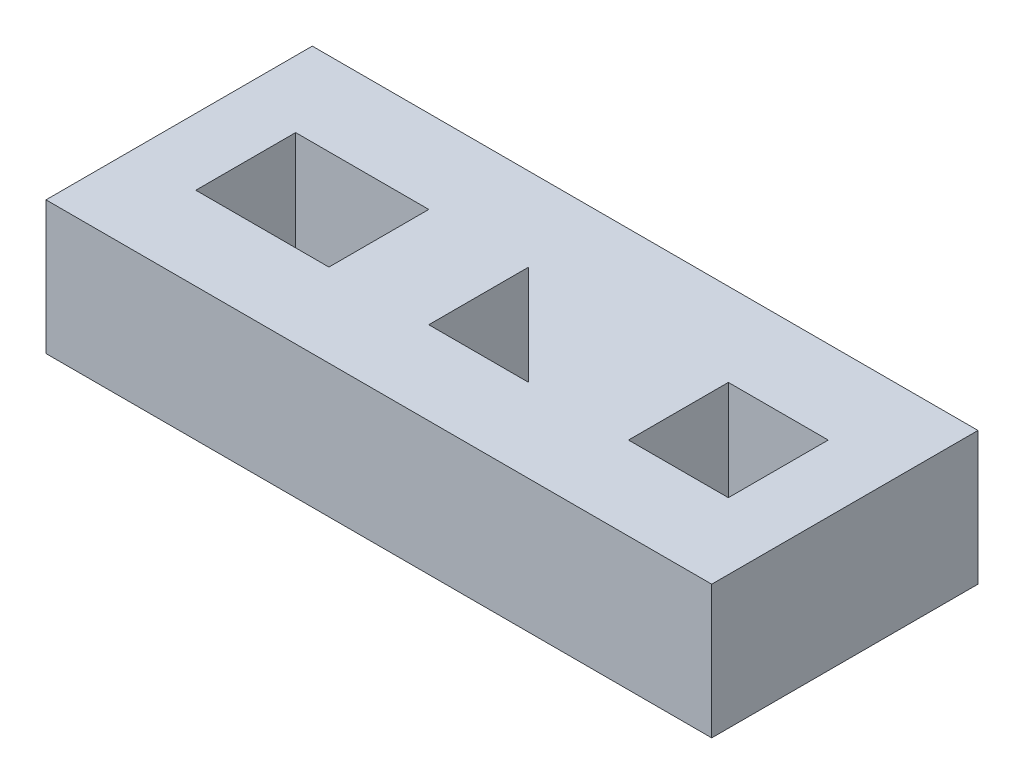
ISO-10303-21;
HEADER;
FILE_DESCRIPTION(('STEP AP214'),'2;1');
FILE_NAME('part.step','',(''),(''),'','','');
FILE_SCHEMA(('AUTOMOTIVE_DESIGN { 1 0 10303 214 1 1 1 1 }'));
ENDSEC;
DATA;
#1=APPLICATION_CONTEXT('core data for automotive mechanical design processes');
#2=APPLICATION_PROTOCOL_DEFINITION('international standard','automotive_design',2000,#1);
#3=PRODUCT_CONTEXT('',#1,'mechanical');
#4=PRODUCT('Part','Part','',(#3));
#5=PRODUCT_RELATED_PRODUCT_CATEGORY('part','',(#4));
#6=PRODUCT_DEFINITION_FORMATION('','',#4);
#7=PRODUCT_DEFINITION_CONTEXT('part definition',#1,'design');
#8=PRODUCT_DEFINITION('design','',#6,#7);
#9=PRODUCT_DEFINITION_SHAPE('','',#8);
#10=(LENGTH_UNIT() NAMED_UNIT(*) SI_UNIT(.MILLI.,.METRE.));
#11=(NAMED_UNIT(*) PLANE_ANGLE_UNIT() SI_UNIT($,.RADIAN.));
#12=(NAMED_UNIT(*) SI_UNIT($,.STERADIAN.) SOLID_ANGLE_UNIT());
#13=UNCERTAINTY_MEASURE_WITH_UNIT(LENGTH_MEASURE(1.E-05),#10,'distance_accuracy_value','');
#14=(GEOMETRIC_REPRESENTATION_CONTEXT(3) GLOBAL_UNCERTAINTY_ASSIGNED_CONTEXT((#13)) GLOBAL_UNIT_ASSIGNED_CONTEXT((#10,
#11,#12)) REPRESENTATION_CONTEXT('',''));
#15=CARTESIAN_POINT('',(0.,0.,0.));
#16=DIRECTION('',(0.,0.,1.));
#17=DIRECTION('',(1.,0.,0.));
#18=AXIS2_PLACEMENT_3D('',#15,#16,#17);
#19=CARTESIAN_POINT('',(0.,25.4,0.));
#20=DIRECTION('',(1.,0.,0.));
#21=DIRECTION('',(0.,0.,-1.));
#22=AXIS2_PLACEMENT_3D('',#19,#20,#21);
#23=PLANE('',#22);
#24=DIRECTION('',(0.,0.,1.));
#25=VECTOR('',#24,1.);
#26=CARTESIAN_POINT('',(0.,0.,0.));
#27=LINE('',#26,#25);
#28=CARTESIAN_POINT('',(0.,0.,-50.8));
#29=VERTEX_POINT('',#28);
#30=CARTESIAN_POINT('',(0.,0.,0.));
#31=VERTEX_POINT('',#30);
#32=EDGE_CURVE('E223',#29,#31,#27,.T.);
#33=ORIENTED_EDGE('',*,*,#32,.T.);
#34=DIRECTION('',(0.,-1.,0.));
#35=VECTOR('',#34,1.);
#36=CARTESIAN_POINT('',(0.,25.4,0.));
#37=LINE('',#36,#35);
#38=CARTESIAN_POINT('',(0.,25.4,0.));
#39=VERTEX_POINT('',#38);
#40=EDGE_CURVE('E11',#39,#31,#37,.T.);
#41=ORIENTED_EDGE('',*,*,#40,.F.);
#42=DIRECTION('',(0.,0.,1.));
#43=VECTOR('',#42,1.);
#44=CARTESIAN_POINT('',(0.,25.4,0.));
#45=LINE('',#44,#43);
#46=CARTESIAN_POINT('',(0.,25.4,-50.8));
#47=VERTEX_POINT('',#46);
#48=EDGE_CURVE('E230',#47,#39,#45,.T.);
#49=ORIENTED_EDGE('',*,*,#48,.F.);
#50=DIRECTION('',(0.,-1.,0.));
#51=VECTOR('',#50,1.);
#52=CARTESIAN_POINT('',(0.,25.4,-50.8));
#53=LINE('',#52,#51);
#54=EDGE_CURVE('E240',#47,#29,#53,.T.);
#55=ORIENTED_EDGE('',*,*,#54,.T.);
#56=EDGE_LOOP('',(#33,#41,#49,#55));
#57=FACE_BOUND('',#56,.T.);
#58=ADVANCED_FACE('F32',(#57),#23,.F.);
#59=CARTESIAN_POINT('',(0.,25.4,0.));
#60=DIRECTION('',(0.,0.,-1.));
#61=DIRECTION('',(-1.,0.,0.));
#62=AXIS2_PLACEMENT_3D('',#59,#60,#61);
#63=PLANE('',#62);
#64=DIRECTION('',(1.,0.,0.));
#65=VECTOR('',#64,1.);
#66=CARTESIAN_POINT('',(0.,0.,0.));
#67=LINE('',#66,#65);
#68=CARTESIAN_POINT('',(127.,0.,0.));
#69=VERTEX_POINT('',#68);
#70=EDGE_CURVE('E243',#31,#69,#67,.T.);
#71=ORIENTED_EDGE('',*,*,#70,.T.);
#72=DIRECTION('',(0.,-1.,0.));
#73=VECTOR('',#72,1.);
#74=CARTESIAN_POINT('',(127.,25.4,0.));
#75=LINE('',#74,#73);
#76=CARTESIAN_POINT('',(127.,25.4,0.));
#77=VERTEX_POINT('',#76);
#78=EDGE_CURVE('E39',#77,#69,#75,.T.);
#79=ORIENTED_EDGE('',*,*,#78,.F.);
#80=DIRECTION('',(1.,0.,0.));
#81=VECTOR('',#80,1.);
#82=CARTESIAN_POINT('',(0.,25.4,0.));
#83=LINE('',#82,#81);
#84=EDGE_CURVE('E233',#39,#77,#83,.T.);
#85=ORIENTED_EDGE('',*,*,#84,.F.);
#86=ORIENTED_EDGE('',*,*,#40,.T.);
#87=EDGE_LOOP('',(#71,#79,#85,#86));
#88=FACE_BOUND('',#87,.T.);
#89=ADVANCED_FACE('F272',(#88),#63,.F.);
#90=CARTESIAN_POINT('',(127.,25.4,0.));
#91=DIRECTION('',(-1.,0.,0.));
#92=DIRECTION('',(0.,0.,1.));
#93=AXIS2_PLACEMENT_3D('',#90,#91,#92);
#94=PLANE('',#93);
#95=DIRECTION('',(0.,0.,-1.));
#96=VECTOR('',#95,1.);
#97=CARTESIAN_POINT('',(127.,0.,0.));
#98=LINE('',#97,#96);
#99=CARTESIAN_POINT('',(127.,0.,-50.8));
#100=VERTEX_POINT('',#99);
#101=EDGE_CURVE('E245',#69,#100,#98,.T.);
#102=ORIENTED_EDGE('',*,*,#101,.T.);
#103=DIRECTION('',(0.,-1.,0.));
#104=VECTOR('',#103,1.);
#105=CARTESIAN_POINT('',(127.,25.4,-50.8));
#106=LINE('',#105,#104);
#107=CARTESIAN_POINT('',(127.,25.4,-50.8));
#108=VERTEX_POINT('',#107);
#109=EDGE_CURVE('E250',#108,#100,#106,.T.);
#110=ORIENTED_EDGE('',*,*,#109,.F.);
#111=DIRECTION('',(0.,0.,-1.));
#112=VECTOR('',#111,1.);
#113=CARTESIAN_POINT('',(127.,25.4,0.));
#114=LINE('',#113,#112);
#115=EDGE_CURVE('E236',#77,#108,#114,.T.);
#116=ORIENTED_EDGE('',*,*,#115,.F.);
#117=ORIENTED_EDGE('',*,*,#78,.T.);
#118=EDGE_LOOP('',(#102,#110,#116,#117));
#119=FACE_BOUND('',#118,.T.);
#120=ADVANCED_FACE('F257',(#119),#94,.F.);
#121=CARTESIAN_POINT('',(0.,25.4,-50.8));
#122=DIRECTION('',(0.,0.,1.));
#123=DIRECTION('',(1.,0.,0.));
#124=AXIS2_PLACEMENT_3D('',#121,#122,#123);
#125=PLANE('',#124);
#126=DIRECTION('',(-1.,0.,0.));
#127=VECTOR('',#126,1.);
#128=CARTESIAN_POINT('',(0.,0.,-50.8));
#129=LINE('',#128,#127);
#130=EDGE_CURVE('E234',#100,#29,#129,.T.);
#131=ORIENTED_EDGE('',*,*,#130,.T.);
#132=ORIENTED_EDGE('',*,*,#54,.F.);
#133=DIRECTION('',(-1.,0.,0.));
#134=VECTOR('',#133,1.);
#135=CARTESIAN_POINT('',(0.,25.4,-50.8));
#136=LINE('',#135,#134);
#137=EDGE_CURVE('E238',#108,#47,#136,.T.);
#138=ORIENTED_EDGE('',*,*,#137,.F.);
#139=ORIENTED_EDGE('',*,*,#109,.T.);
#140=EDGE_LOOP('',(#131,#132,#138,#139));
#141=FACE_BOUND('',#140,.T.);
#142=ADVANCED_FACE('F265',(#141),#125,.F.);
#143=CARTESIAN_POINT('',(0.,25.4,0.));
#144=DIRECTION('',(0.,-1.,0.));
#145=DIRECTION('',(0.,0.,-1.));
#146=AXIS2_PLACEMENT_3D('',#143,#144,#145);
#147=PLANE('',#146);
#148=DIRECTION('',(0.,0.,1.));
#149=VECTOR('',#148,1.);
#150=CARTESIAN_POINT('',(57.15,25.4,-34.925));
#151=LINE('',#150,#149);
#152=CARTESIAN_POINT('',(57.15,25.4,-34.925));
#153=VERTEX_POINT('',#152);
#154=CARTESIAN_POINT('',(57.15,25.4,-15.875));
#155=VERTEX_POINT('',#154);
#156=EDGE_CURVE('E156',#153,#155,#151,.T.);
#157=ORIENTED_EDGE('',*,*,#156,.F.);
#158=DIRECTION('',(-0.707106781186548,0.,-0.707106781186547));
#159=VECTOR('',#158,1.);
#160=CARTESIAN_POINT('',(76.2,25.4,-15.875));
#161=LINE('',#160,#159);
#162=CARTESIAN_POINT('',(76.2,25.4,-15.875));
#163=VERTEX_POINT('',#162);
#164=EDGE_CURVE('E46',#163,#153,#161,.T.);
#165=ORIENTED_EDGE('',*,*,#164,.F.);
#166=DIRECTION('',(1.,0.,0.));
#167=VECTOR('',#166,1.);
#168=CARTESIAN_POINT('',(57.15,25.4,-15.875));
#169=LINE('',#168,#167);
#170=EDGE_CURVE('E153',#155,#163,#169,.T.);
#171=ORIENTED_EDGE('',*,*,#170,.F.);
#172=EDGE_LOOP('',(#157,#165,#171));
#173=FACE_BOUND('',#172,.T.);
#174=DIRECTION('',(1.,0.,0.));
#175=VECTOR('',#174,1.);
#176=CARTESIAN_POINT('',(95.25,25.4,-15.875));
#177=LINE('',#176,#175);
#178=CARTESIAN_POINT('',(95.25,25.4,-15.875));
#179=VERTEX_POINT('',#178);
#180=CARTESIAN_POINT('',(114.3,25.4,-15.875));
#181=VERTEX_POINT('',#180);
#182=EDGE_CURVE('E181',#179,#181,#177,.T.);
#183=ORIENTED_EDGE('',*,*,#182,.F.);
#184=DIRECTION('',(0.,0.,1.));
#185=VECTOR('',#184,1.);
#186=CARTESIAN_POINT('',(95.25,25.4,-15.875));
#187=LINE('',#186,#185);
#188=CARTESIAN_POINT('',(95.25,25.4,-34.925));
#189=VERTEX_POINT('',#188);
#190=EDGE_CURVE('E164',#189,#179,#187,.T.);
#191=ORIENTED_EDGE('',*,*,#190,.F.);
#192=DIRECTION('',(-1.,0.,0.));
#193=VECTOR('',#192,1.);
#194=CARTESIAN_POINT('',(95.25,25.4,-34.925));
#195=LINE('',#194,#193);
#196=CARTESIAN_POINT('',(114.3,25.4,-34.925));
#197=VERTEX_POINT('',#196);
#198=EDGE_CURVE('E170',#197,#189,#195,.T.);
#199=ORIENTED_EDGE('',*,*,#198,.F.);
#200=DIRECTION('',(0.,0.,-1.));
#201=VECTOR('',#200,1.);
#202=CARTESIAN_POINT('',(114.3,25.4,-15.875));
#203=LINE('',#202,#201);
#204=EDGE_CURVE('E184',#181,#197,#203,.T.);
#205=ORIENTED_EDGE('',*,*,#204,.F.);
#206=EDGE_LOOP('',(#183,#191,#199,#205));
#207=FACE_BOUND('',#206,.T.);
#208=DIRECTION('',(1.,0.,0.));
#209=VECTOR('',#208,1.);
#210=CARTESIAN_POINT('',(12.7,25.4,-15.875));
#211=LINE('',#210,#209);
#212=CARTESIAN_POINT('',(12.7,25.4,-15.875));
#213=VERTEX_POINT('',#212);
#214=CARTESIAN_POINT('',(38.1,25.4,-15.875));
#215=VERTEX_POINT('',#214);
#216=EDGE_CURVE('E213',#213,#215,#211,.T.);
#217=ORIENTED_EDGE('',*,*,#216,.F.);
#218=DIRECTION('',(0.,0.,1.));
#219=VECTOR('',#218,1.);
#220=CARTESIAN_POINT('',(12.7,25.4,-15.875));
#221=LINE('',#220,#219);
#222=CARTESIAN_POINT('',(12.7,25.4,-34.925));
#223=VERTEX_POINT('',#222);
#224=EDGE_CURVE('E191',#223,#213,#221,.T.);
#225=ORIENTED_EDGE('',*,*,#224,.F.);
#226=DIRECTION('',(-1.,0.,0.));
#227=VECTOR('',#226,1.);
#228=CARTESIAN_POINT('',(12.7,25.4,-34.925));
#229=LINE('',#228,#227);
#230=CARTESIAN_POINT('',(38.1,25.4,-34.925));
#231=VERTEX_POINT('',#230);
#232=EDGE_CURVE('E202',#231,#223,#229,.T.);
#233=ORIENTED_EDGE('',*,*,#232,.F.);
#234=DIRECTION('',(0.,0.,-1.));
#235=VECTOR('',#234,1.);
#236=CARTESIAN_POINT('',(38.1,25.4,-15.875));
#237=LINE('',#236,#235);
#238=EDGE_CURVE('E216',#215,#231,#237,.T.);
#239=ORIENTED_EDGE('',*,*,#238,.F.);
#240=EDGE_LOOP('',(#217,#225,#233,#239));
#241=FACE_BOUND('',#240,.T.);
#242=ORIENTED_EDGE('',*,*,#48,.T.);
#243=ORIENTED_EDGE('',*,*,#84,.T.);
#244=ORIENTED_EDGE('',*,*,#115,.T.);
#245=ORIENTED_EDGE('',*,*,#137,.T.);
#246=EDGE_LOOP('',(#242,#243,#244,#245));
#247=FACE_BOUND('',#246,.T.);
#248=ADVANCED_FACE('F271',(#173,#207,#241,#247),#147,.F.);
#249=CARTESIAN_POINT('',(0.,0.,0.));
#250=DIRECTION('',(0.,-1.,0.));
#251=DIRECTION('',(0.,0.,-1.));
#252=AXIS2_PLACEMENT_3D('',#249,#250,#251);
#253=PLANE('',#252);
#254=DIRECTION('',(-0.707106781186548,0.,-0.707106781186547));
#255=VECTOR('',#254,1.);
#256=CARTESIAN_POINT('',(76.2,0.,-15.875));
#257=LINE('',#256,#255);
#258=CARTESIAN_POINT('',(76.2,0.,-15.875));
#259=VERTEX_POINT('',#258);
#260=CARTESIAN_POINT('',(57.15,0.,-34.925));
#261=VERTEX_POINT('',#260);
#262=EDGE_CURVE('E140',#259,#261,#257,.T.);
#263=ORIENTED_EDGE('',*,*,#262,.T.);
#264=DIRECTION('',(0.,0.,1.));
#265=VECTOR('',#264,1.);
#266=CARTESIAN_POINT('',(57.15,0.,-34.925));
#267=LINE('',#266,#265);
#268=CARTESIAN_POINT('',(57.15,0.,-15.875));
#269=VERTEX_POINT('',#268);
#270=EDGE_CURVE('E147',#261,#269,#267,.T.);
#271=ORIENTED_EDGE('',*,*,#270,.T.);
#272=DIRECTION('',(1.,0.,0.));
#273=VECTOR('',#272,1.);
#274=CARTESIAN_POINT('',(57.15,0.,-15.875));
#275=LINE('',#274,#273);
#276=EDGE_CURVE('E54',#269,#259,#275,.T.);
#277=ORIENTED_EDGE('',*,*,#276,.T.);
#278=EDGE_LOOP('',(#263,#271,#277));
#279=FACE_BOUND('',#278,.T.);
#280=DIRECTION('',(0.,0.,1.));
#281=VECTOR('',#280,1.);
#282=CARTESIAN_POINT('',(95.25,0.,-15.875));
#283=LINE('',#282,#281);
#284=CARTESIAN_POINT('',(95.25,0.,-34.925));
#285=VERTEX_POINT('',#284);
#286=CARTESIAN_POINT('',(95.25,0.,-15.875));
#287=VERTEX_POINT('',#286);
#288=EDGE_CURVE('E166',#285,#287,#283,.T.);
#289=ORIENTED_EDGE('',*,*,#288,.T.);
#290=DIRECTION('',(1.,0.,0.));
#291=VECTOR('',#290,1.);
#292=CARTESIAN_POINT('',(95.25,0.,-15.875));
#293=LINE('',#292,#291);
#294=CARTESIAN_POINT('',(114.3,0.,-15.875));
#295=VERTEX_POINT('',#294);
#296=EDGE_CURVE('E169',#287,#295,#293,.T.);
#297=ORIENTED_EDGE('',*,*,#296,.T.);
#298=DIRECTION('',(0.,0.,-1.));
#299=VECTOR('',#298,1.);
#300=CARTESIAN_POINT('',(114.3,0.,-15.875));
#301=LINE('',#300,#299);
#302=CARTESIAN_POINT('',(114.3,0.,-34.925));
#303=VERTEX_POINT('',#302);
#304=EDGE_CURVE('E173',#295,#303,#301,.T.);
#305=ORIENTED_EDGE('',*,*,#304,.T.);
#306=DIRECTION('',(-1.,0.,0.));
#307=VECTOR('',#306,1.);
#308=CARTESIAN_POINT('',(95.25,0.,-34.925));
#309=LINE('',#308,#307);
#310=EDGE_CURVE('E176',#303,#285,#309,.T.);
#311=ORIENTED_EDGE('',*,*,#310,.T.);
#312=EDGE_LOOP('',(#289,#297,#305,#311));
#313=FACE_BOUND('',#312,.T.);
#314=DIRECTION('',(0.,0.,1.));
#315=VECTOR('',#314,1.);
#316=CARTESIAN_POINT('',(12.7,0.,-15.875));
#317=LINE('',#316,#315);
#318=CARTESIAN_POINT('',(12.7,0.,-34.925));
#319=VERTEX_POINT('',#318);
#320=CARTESIAN_POINT('',(12.7,0.,-15.875));
#321=VERTEX_POINT('',#320);
#322=EDGE_CURVE('E198',#319,#321,#317,.T.);
#323=ORIENTED_EDGE('',*,*,#322,.T.);
#324=DIRECTION('',(1.,0.,0.));
#325=VECTOR('',#324,1.);
#326=CARTESIAN_POINT('',(12.7,0.,-15.875));
#327=LINE('',#326,#325);
#328=CARTESIAN_POINT('',(38.1,0.,-15.875));
#329=VERTEX_POINT('',#328);
#330=EDGE_CURVE('E201',#321,#329,#327,.T.);
#331=ORIENTED_EDGE('',*,*,#330,.T.);
#332=DIRECTION('',(0.,0.,-1.));
#333=VECTOR('',#332,1.);
#334=CARTESIAN_POINT('',(38.1,0.,-15.875));
#335=LINE('',#334,#333);
#336=CARTESIAN_POINT('',(38.1,0.,-34.925));
#337=VERTEX_POINT('',#336);
#338=EDGE_CURVE('E205',#329,#337,#335,.T.);
#339=ORIENTED_EDGE('',*,*,#338,.T.);
#340=DIRECTION('',(-1.,0.,0.));
#341=VECTOR('',#340,1.);
#342=CARTESIAN_POINT('',(12.7,0.,-34.925));
#343=LINE('',#342,#341);
#344=EDGE_CURVE('E208',#337,#319,#343,.T.);
#345=ORIENTED_EDGE('',*,*,#344,.T.);
#346=EDGE_LOOP('',(#323,#331,#339,#345));
#347=FACE_BOUND('',#346,.T.);
#348=ORIENTED_EDGE('',*,*,#32,.F.);
#349=ORIENTED_EDGE('',*,*,#130,.F.);
#350=ORIENTED_EDGE('',*,*,#101,.F.);
#351=ORIENTED_EDGE('',*,*,#70,.F.);
#352=EDGE_LOOP('',(#348,#349,#350,#351));
#353=FACE_BOUND('',#352,.T.);
#354=ADVANCED_FACE('F151',(#279,#313,#347,#353),#253,.T.);
#355=CARTESIAN_POINT('',(12.7,0.,-15.875));
#356=DIRECTION('',(-1.,0.,0.));
#357=DIRECTION('',(0.,0.,1.));
#358=AXIS2_PLACEMENT_3D('',#355,#356,#357);
#359=PLANE('',#358);
#360=ORIENTED_EDGE('',*,*,#224,.T.);
#361=DIRECTION('',(0.,1.,0.));
#362=VECTOR('',#361,1.);
#363=CARTESIAN_POINT('',(12.7,0.,-15.875));
#364=LINE('',#363,#362);
#365=EDGE_CURVE('E211',#321,#213,#364,.T.);
#366=ORIENTED_EDGE('',*,*,#365,.F.);
#367=ORIENTED_EDGE('',*,*,#322,.F.);
#368=DIRECTION('',(0.,1.,0.));
#369=VECTOR('',#368,1.);
#370=CARTESIAN_POINT('',(12.7,0.,-34.925));
#371=LINE('',#370,#369);
#372=EDGE_CURVE('E221',#319,#223,#371,.T.);
#373=ORIENTED_EDGE('',*,*,#372,.T.);
#374=EDGE_LOOP('',(#360,#366,#367,#373));
#375=FACE_BOUND('',#374,.T.);
#376=ADVANCED_FACE('F284',(#375),#359,.F.);
#377=CARTESIAN_POINT('',(12.7,0.,-34.925));
#378=DIRECTION('',(0.,0.,-1.));
#379=DIRECTION('',(-1.,0.,0.));
#380=AXIS2_PLACEMENT_3D('',#377,#378,#379);
#381=PLANE('',#380);
#382=ORIENTED_EDGE('',*,*,#232,.T.);
#383=ORIENTED_EDGE('',*,*,#372,.F.);
#384=ORIENTED_EDGE('',*,*,#344,.F.);
#385=DIRECTION('',(0.,1.,0.));
#386=VECTOR('',#385,1.);
#387=CARTESIAN_POINT('',(38.1,0.,-34.925));
#388=LINE('',#387,#386);
#389=EDGE_CURVE('E224',#337,#231,#388,.T.);
#390=ORIENTED_EDGE('',*,*,#389,.T.);
#391=EDGE_LOOP('',(#382,#383,#384,#390));
#392=FACE_BOUND('',#391,.T.);
#393=ADVANCED_FACE('F290',(#392),#381,.F.);
#394=CARTESIAN_POINT('',(38.1,0.,-15.875));
#395=DIRECTION('',(1.,0.,0.));
#396=DIRECTION('',(0.,0.,-1.));
#397=AXIS2_PLACEMENT_3D('',#394,#395,#396);
#398=PLANE('',#397);
#399=ORIENTED_EDGE('',*,*,#238,.T.);
#400=ORIENTED_EDGE('',*,*,#389,.F.);
#401=ORIENTED_EDGE('',*,*,#338,.F.);
#402=DIRECTION('',(0.,1.,0.));
#403=VECTOR('',#402,1.);
#404=CARTESIAN_POINT('',(38.1,0.,-15.875));
#405=LINE('',#404,#403);
#406=EDGE_CURVE('E226',#329,#215,#405,.T.);
#407=ORIENTED_EDGE('',*,*,#406,.T.);
#408=EDGE_LOOP('',(#399,#400,#401,#407));
#409=FACE_BOUND('',#408,.T.);
#410=ADVANCED_FACE('F296',(#409),#398,.F.);
#411=CARTESIAN_POINT('',(12.7,0.,-15.875));
#412=DIRECTION('',(0.,0.,1.));
#413=DIRECTION('',(1.,0.,0.));
#414=AXIS2_PLACEMENT_3D('',#411,#412,#413);
#415=PLANE('',#414);
#416=ORIENTED_EDGE('',*,*,#216,.T.);
#417=ORIENTED_EDGE('',*,*,#406,.F.);
#418=ORIENTED_EDGE('',*,*,#330,.F.);
#419=ORIENTED_EDGE('',*,*,#365,.T.);
#420=EDGE_LOOP('',(#416,#417,#418,#419));
#421=FACE_BOUND('',#420,.T.);
#422=ADVANCED_FACE('F292',(#421),#415,.F.);
#423=CARTESIAN_POINT('',(95.25,0.,-15.875));
#424=DIRECTION('',(-1.,0.,0.));
#425=DIRECTION('',(0.,0.,1.));
#426=AXIS2_PLACEMENT_3D('',#423,#424,#425);
#427=PLANE('',#426);
#428=ORIENTED_EDGE('',*,*,#190,.T.);
#429=DIRECTION('',(0.,1.,0.));
#430=VECTOR('',#429,1.);
#431=CARTESIAN_POINT('',(95.25,0.,-15.875));
#432=LINE('',#431,#430);
#433=EDGE_CURVE('E179',#287,#179,#432,.T.);
#434=ORIENTED_EDGE('',*,*,#433,.F.);
#435=ORIENTED_EDGE('',*,*,#288,.F.);
#436=DIRECTION('',(0.,1.,0.));
#437=VECTOR('',#436,1.);
#438=CARTESIAN_POINT('',(95.25,0.,-34.925));
#439=LINE('',#438,#437);
#440=EDGE_CURVE('E189',#285,#189,#439,.T.);
#441=ORIENTED_EDGE('',*,*,#440,.T.);
#442=EDGE_LOOP('',(#428,#434,#435,#441));
#443=FACE_BOUND('',#442,.T.);
#444=ADVANCED_FACE('F295',(#443),#427,.F.);
#445=CARTESIAN_POINT('',(95.25,0.,-34.925));
#446=DIRECTION('',(0.,0.,-1.));
#447=DIRECTION('',(-1.,0.,0.));
#448=AXIS2_PLACEMENT_3D('',#445,#446,#447);
#449=PLANE('',#448);
#450=ORIENTED_EDGE('',*,*,#198,.T.);
#451=ORIENTED_EDGE('',*,*,#440,.F.);
#452=ORIENTED_EDGE('',*,*,#310,.F.);
#453=DIRECTION('',(0.,1.,0.));
#454=VECTOR('',#453,1.);
#455=CARTESIAN_POINT('',(114.3,0.,-34.925));
#456=LINE('',#455,#454);
#457=EDGE_CURVE('E192',#303,#197,#456,.T.);
#458=ORIENTED_EDGE('',*,*,#457,.T.);
#459=EDGE_LOOP('',(#450,#451,#452,#458));
#460=FACE_BOUND('',#459,.T.);
#461=ADVANCED_FACE('F306',(#460),#449,.F.);
#462=CARTESIAN_POINT('',(114.3,0.,-15.875));
#463=DIRECTION('',(1.,0.,0.));
#464=DIRECTION('',(0.,0.,-1.));
#465=AXIS2_PLACEMENT_3D('',#462,#463,#464);
#466=PLANE('',#465);
#467=ORIENTED_EDGE('',*,*,#204,.T.);
#468=ORIENTED_EDGE('',*,*,#457,.F.);
#469=ORIENTED_EDGE('',*,*,#304,.F.);
#470=DIRECTION('',(0.,1.,0.));
#471=VECTOR('',#470,1.);
#472=CARTESIAN_POINT('',(114.3,0.,-15.875));
#473=LINE('',#472,#471);
#474=EDGE_CURVE('E194',#295,#181,#473,.T.);
#475=ORIENTED_EDGE('',*,*,#474,.T.);
#476=EDGE_LOOP('',(#467,#468,#469,#475));
#477=FACE_BOUND('',#476,.T.);
#478=ADVANCED_FACE('F311',(#477),#466,.F.);
#479=CARTESIAN_POINT('',(95.25,0.,-15.875));
#480=DIRECTION('',(0.,0.,1.));
#481=DIRECTION('',(1.,0.,0.));
#482=AXIS2_PLACEMENT_3D('',#479,#480,#481);
#483=PLANE('',#482);
#484=ORIENTED_EDGE('',*,*,#182,.T.);
#485=ORIENTED_EDGE('',*,*,#474,.F.);
#486=ORIENTED_EDGE('',*,*,#296,.F.);
#487=ORIENTED_EDGE('',*,*,#433,.T.);
#488=EDGE_LOOP('',(#484,#485,#486,#487));
#489=FACE_BOUND('',#488,.T.);
#490=ADVANCED_FACE('F308',(#489),#483,.F.);
#491=CARTESIAN_POINT('',(76.2,0.,-15.875));
#492=DIRECTION('',(0.707106781186547,0.,-0.707106781186548));
#493=DIRECTION('',(-0.707106781186548,0.,-0.707106781186547));
#494=AXIS2_PLACEMENT_3D('',#491,#492,#493);
#495=PLANE('',#494);
#496=ORIENTED_EDGE('',*,*,#164,.T.);
#497=DIRECTION('',(0.,1.,0.));
#498=VECTOR('',#497,1.);
#499=CARTESIAN_POINT('',(57.15,0.,-34.925));
#500=LINE('',#499,#498);
#501=EDGE_CURVE('E136',#261,#153,#500,.T.);
#502=ORIENTED_EDGE('',*,*,#501,.F.);
#503=ORIENTED_EDGE('',*,*,#262,.F.);
#504=DIRECTION('',(0.,1.,0.));
#505=VECTOR('',#504,1.);
#506=CARTESIAN_POINT('',(76.2,0.,-15.875));
#507=LINE('',#506,#505);
#508=EDGE_CURVE('E162',#259,#163,#507,.T.);
#509=ORIENTED_EDGE('',*,*,#508,.T.);
#510=EDGE_LOOP('',(#496,#502,#503,#509));
#511=FACE_BOUND('',#510,.T.);
#512=ADVANCED_FACE('F138',(#511),#495,.F.);
#513=CARTESIAN_POINT('',(57.15,0.,-15.875));
#514=DIRECTION('',(0.,0.,1.));
#515=DIRECTION('',(1.,0.,0.));
#516=AXIS2_PLACEMENT_3D('',#513,#514,#515);
#517=PLANE('',#516);
#518=ORIENTED_EDGE('',*,*,#170,.T.);
#519=ORIENTED_EDGE('',*,*,#508,.F.);
#520=ORIENTED_EDGE('',*,*,#276,.F.);
#521=DIRECTION('',(0.,1.,0.));
#522=VECTOR('',#521,1.);
#523=CARTESIAN_POINT('',(57.15,0.,-15.875));
#524=LINE('',#523,#522);
#525=EDGE_CURVE('E144',#269,#155,#524,.T.);
#526=ORIENTED_EDGE('',*,*,#525,.T.);
#527=EDGE_LOOP('',(#518,#519,#520,#526));
#528=FACE_BOUND('',#527,.T.);
#529=ADVANCED_FACE('F321',(#528),#517,.F.);
#530=CARTESIAN_POINT('',(57.15,0.,-34.925));
#531=DIRECTION('',(-1.,0.,0.));
#532=DIRECTION('',(0.,0.,1.));
#533=AXIS2_PLACEMENT_3D('',#530,#531,#532);
#534=PLANE('',#533);
#535=ORIENTED_EDGE('',*,*,#156,.T.);
#536=ORIENTED_EDGE('',*,*,#525,.F.);
#537=ORIENTED_EDGE('',*,*,#270,.F.);
#538=ORIENTED_EDGE('',*,*,#501,.T.);
#539=EDGE_LOOP('',(#535,#536,#537,#538));
#540=FACE_BOUND('',#539,.T.);
#541=ADVANCED_FACE('F148',(#540),#534,.F.);
#542=CLOSED_SHELL('',(#58,#89,#120,#142,#248,#354,#376,#393,#410,#422,#444,#461,#478,#490,#512,
#529,#541));
#543=MANIFOLD_SOLID_BREP('B2',#542);
#544=ADVANCED_BREP_SHAPE_REPRESENTATION('',(#18,#543),#14);
#545=SHAPE_DEFINITION_REPRESENTATION(#9,#544);
ENDSEC;
END-ISO-10303-21;
